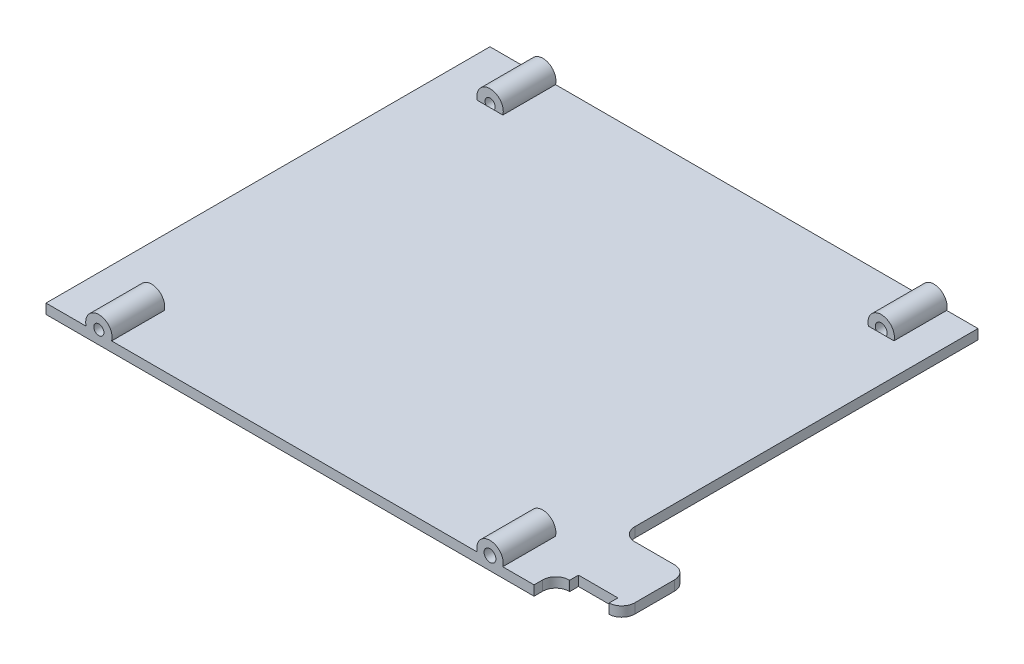
ISO-10303-21;
HEADER;
FILE_DESCRIPTION(('STEP AP214'),'2;1');
FILE_NAME('part.step','',(''),(''),'','','');
FILE_SCHEMA(('AUTOMOTIVE_DESIGN { 1 0 10303 214 1 1 1 1 }'));
ENDSEC;
DATA;
#1=APPLICATION_CONTEXT('core data for automotive mechanical design processes');
#2=APPLICATION_PROTOCOL_DEFINITION('international standard','automotive_design',2000,#1);
#3=PRODUCT_CONTEXT('',#1,'mechanical');
#4=PRODUCT('Part','Part','',(#3));
#5=PRODUCT_RELATED_PRODUCT_CATEGORY('part','',(#4));
#6=PRODUCT_DEFINITION_FORMATION('','',#4);
#7=PRODUCT_DEFINITION_CONTEXT('part definition',#1,'design');
#8=PRODUCT_DEFINITION('design','',#6,#7);
#9=PRODUCT_DEFINITION_SHAPE('','',#8);
#10=(LENGTH_UNIT() NAMED_UNIT(*) SI_UNIT(.MILLI.,.METRE.));
#11=(NAMED_UNIT(*) PLANE_ANGLE_UNIT() SI_UNIT($,.RADIAN.));
#12=(NAMED_UNIT(*) SI_UNIT($,.STERADIAN.) SOLID_ANGLE_UNIT());
#13=UNCERTAINTY_MEASURE_WITH_UNIT(LENGTH_MEASURE(1.E-05),#10,'distance_accuracy_value','');
#14=(GEOMETRIC_REPRESENTATION_CONTEXT(3) GLOBAL_UNCERTAINTY_ASSIGNED_CONTEXT((#13)) GLOBAL_UNIT_ASSIGNED_CONTEXT((#10,
#11,#12)) REPRESENTATION_CONTEXT('',''));
#15=CARTESIAN_POINT('',(0.,0.,0.));
#16=DIRECTION('',(0.,0.,1.));
#17=DIRECTION('',(1.,0.,0.));
#18=AXIS2_PLACEMENT_3D('',#15,#16,#17);
#19=CARTESIAN_POINT('',(-85.5905303741347,-18.8675075749451,141.47256301662));
#20=DIRECTION('',(-1.,0.,0.));
#21=DIRECTION('',(0.,-1.,0.));
#22=AXIS2_PLACEMENT_3D('',#19,#20,#21);
#23=PLANE('',#22);
#24=DIRECTION('',(0.,0.999999944421006,-0.000333403637407651));
#25=VECTOR('',#24,1.);
#26=CARTESIAN_POINT('',(-85.5905303741347,-20.3675075749451,52.0805001054825));
#27=LINE('',#26,#25);
#28=CARTESIAN_POINT('',(-85.5905303741347,-20.3675075749451,52.0805001054825));
#29=VERTEX_POINT('',#28);
#30=CARTESIAN_POINT('',(-85.5905303741347,-18.8675075749451,52.0799999999986));
#31=VERTEX_POINT('',#30);
#32=EDGE_CURVE('E249',#29,#31,#27,.T.);
#33=ORIENTED_EDGE('',*,*,#32,.F.);
#34=DIRECTION('',(0.,0.,-1.));
#35=VECTOR('',#34,1.);
#36=CARTESIAN_POINT('',(-85.5905303741347,-20.3675075749451,141.47256301662));
#37=LINE('',#36,#35);
#38=CARTESIAN_POINT('',(-85.5905303741347,-20.3675075749451,0.));
#39=VERTEX_POINT('',#38);
#40=EDGE_CURVE('E398',#29,#39,#37,.T.);
#41=ORIENTED_EDGE('',*,*,#40,.T.);
#42=DIRECTION('',(0.,1.,0.));
#43=VECTOR('',#42,1.);
#44=CARTESIAN_POINT('',(-85.5905303741347,-18.8675075749451,0.));
#45=LINE('',#44,#43);
#46=CARTESIAN_POINT('',(-85.5905303741347,-18.8675075749451,0.));
#47=VERTEX_POINT('',#46);
#48=EDGE_CURVE('E390',#39,#47,#45,.T.);
#49=ORIENTED_EDGE('',*,*,#48,.T.);
#50=DIRECTION('',(0.,0.,-1.));
#51=VECTOR('',#50,1.);
#52=CARTESIAN_POINT('',(-85.5905303741347,-18.8675075749451,141.47256301662));
#53=LINE('',#52,#51);
#54=EDGE_CURVE('E393',#31,#47,#53,.T.);
#55=ORIENTED_EDGE('',*,*,#54,.F.);
#56=EDGE_LOOP('',(#33,#41,#49,#55));
#57=FACE_BOUND('',#56,.T.);
#58=ADVANCED_FACE('F39',(#57),#23,.F.);
#59=CARTESIAN_POINT('',(-159.667908124511,-18.8675075749451,141.47256301662));
#60=DIRECTION('',(0.,-1.,0.));
#61=DIRECTION('',(1.,0.,0.));
#62=AXIS2_PLACEMENT_3D('',#59,#60,#61);
#63=PLANE('',#62);
#64=DIRECTION('',(1.,0.,0.));
#65=VECTOR('',#64,1.);
#66=CARTESIAN_POINT('',(-159.667908124511,-18.8675075749451,62.7311529803631));
#67=LINE('',#66,#65);
#68=CARTESIAN_POINT('',(-83.4954652130825,-18.8675075749451,62.7311529803631));
#69=VERTEX_POINT('',#68);
#70=CARTESIAN_POINT('',(-77.5092926086521,-18.8675075749451,62.7311529803631));
#71=VERTEX_POINT('',#70);
#72=EDGE_CURVE('E224',#69,#71,#67,.T.);
#73=ORIENTED_EDGE('',*,*,#72,.T.);
#74=DIRECTION('',(0.,0.,1.));
#75=VECTOR('',#74,1.);
#76=CARTESIAN_POINT('',(-77.5092926086521,-18.8675075749451,141.47256301662));
#77=LINE('',#76,#75);
#78=CARTESIAN_POINT('',(-77.5092926086521,-18.8675075749449,64.0783494252642));
#79=VERTEX_POINT('',#78);
#80=EDGE_CURVE('E242',#71,#79,#77,.T.);
#81=ORIENTED_EDGE('',*,*,#80,.T.);
#82=CARTESIAN_POINT('',(-77.5905303741347,-18.867507574945,62.0799999999986));
#83=DIRECTION('',(0.,-1.,0.));
#84=DIRECTION('',(1.,0.,0.));
#85=AXIS2_PLACEMENT_3D('',#82,#83,#84);
#86=CIRCLE('',#85,2.);
#87=CARTESIAN_POINT('',(-75.5905303741347,-18.867507574945,62.0799999999986));
#88=VERTEX_POINT('',#87);
#89=EDGE_CURVE('E261',#88,#79,#86,.T.);
#90=ORIENTED_EDGE('',*,*,#89,.F.);
#91=DIRECTION('',(0.,0.,1.));
#92=VECTOR('',#91,1.);
#93=CARTESIAN_POINT('',(-75.5905303741347,-18.867507574945,52.0799999999985));
#94=LINE('',#93,#92);
#95=CARTESIAN_POINT('',(-75.5905303741347,-18.867507574945,56.0799999999986));
#96=VERTEX_POINT('',#95);
#97=EDGE_CURVE('E258',#96,#88,#94,.T.);
#98=ORIENTED_EDGE('',*,*,#97,.F.);
#99=CARTESIAN_POINT('',(-77.5905303741347,-18.867507574945,56.0799999999986));
#100=DIRECTION('',(0.,-1.,0.));
#101=DIRECTION('',(1.,0.,0.));
#102=AXIS2_PLACEMENT_3D('',#99,#100,#101);
#103=CIRCLE('',#102,2.);
#104=CARTESIAN_POINT('',(-77.5905303741347,-18.867507574945,54.0799999999986));
#105=VERTEX_POINT('',#104);
#106=EDGE_CURVE('E255',#105,#96,#103,.T.);
#107=ORIENTED_EDGE('',*,*,#106,.F.);
#108=DIRECTION('',(1.,0.,0.));
#109=VECTOR('',#108,1.);
#110=CARTESIAN_POINT('',(-33.1479999999989,-18.8675075749446,54.0799999999986));
#111=LINE('',#110,#109);
#112=CARTESIAN_POINT('',(-83.5905303741347,-18.8675075749451,54.0799999999986));
#113=VERTEX_POINT('',#112);
#114=EDGE_CURVE('E253',#113,#105,#111,.T.);
#115=ORIENTED_EDGE('',*,*,#114,.F.);
#116=CARTESIAN_POINT('',(-83.5905303741347,-18.8675075749451,52.0799999999986));
#117=DIRECTION('',(0.,-1.,0.));
#118=DIRECTION('',(1.,0.,0.));
#119=AXIS2_PLACEMENT_3D('',#116,#117,#118);
#120=CIRCLE('',#119,2.);
#121=EDGE_CURVE('E62',#113,#31,#120,.T.);
#122=ORIENTED_EDGE('',*,*,#121,.T.);
#123=ORIENTED_EDGE('',*,*,#54,.T.);
#124=DIRECTION('',(-1.,0.,0.));
#125=VECTOR('',#124,1.);
#126=CARTESIAN_POINT('',(-159.667908124511,-18.8675075749451,0.));
#127=LINE('',#126,#125);
#128=CARTESIAN_POINT('',(-90.3438704257039,-18.8675075749451,0.));
#129=VERTEX_POINT('',#128);
#130=EDGE_CURVE('E386',#47,#129,#127,.T.);
#131=ORIENTED_EDGE('',*,*,#130,.T.);
#132=DIRECTION('',(0.,0.,-1.));
#133=VECTOR('',#132,1.);
#134=CARTESIAN_POINT('',(-90.3438704257039,-18.8675075749451,8.));
#135=LINE('',#134,#133);
#136=CARTESIAN_POINT('',(-90.3438704257039,-18.8675075749451,8.));
#137=VERTEX_POINT('',#136);
#138=EDGE_CURVE('E360',#137,#129,#135,.T.);
#139=ORIENTED_EDGE('',*,*,#138,.F.);
#140=DIRECTION('',(-1.,0.,0.));
#141=VECTOR('',#140,1.);
#142=CARTESIAN_POINT('',(-159.667908124511,-18.8675075749451,8.00000000000001));
#143=LINE('',#142,#141);
#144=CARTESIAN_POINT('',(-91.5320306214526,-18.8675075749451,8.));
#145=VERTEX_POINT('',#144);
#146=EDGE_CURVE('E420',#137,#145,#143,.T.);
#147=ORIENTED_EDGE('',*,*,#146,.T.);
#148=CARTESIAN_POINT('',(-93.0286935761624,-18.8675075749451,8.));
#149=VERTEX_POINT('',#148);
#150=EDGE_CURVE('E424',#145,#149,#143,.T.);
#151=ORIENTED_EDGE('',*,*,#150,.T.);
#152=CARTESIAN_POINT('',(-94.2168537719112,-18.8675075749451,8.));
#153=VERTEX_POINT('',#152);
#154=EDGE_CURVE('E402',#149,#153,#143,.T.);
#155=ORIENTED_EDGE('',*,*,#154,.T.);
#156=DIRECTION('',(0.,0.,-1.));
#157=VECTOR('',#156,1.);
#158=CARTESIAN_POINT('',(-94.2168537719112,-18.8675075749451,8.));
#159=LINE('',#158,#157);
#160=CARTESIAN_POINT('',(-94.2168537719112,-18.8675075749451,0.));
#161=VERTEX_POINT('',#160);
#162=EDGE_CURVE('E371',#161,#153,#159,.F.);
#163=ORIENTED_EDGE('',*,*,#162,.F.);
#164=CARTESIAN_POINT('',(-149.708016259504,-18.8675075749451,0.));
#165=VERTEX_POINT('',#164);
#166=EDGE_CURVE('E388',#161,#165,#127,.T.);
#167=ORIENTED_EDGE('',*,*,#166,.T.);
#168=DIRECTION('',(0.,0.,-1.));
#169=VECTOR('',#168,1.);
#170=CARTESIAN_POINT('',(-149.708016259504,-18.8675075749451,8.));
#171=LINE('',#170,#169);
#172=CARTESIAN_POINT('',(-149.708016259504,-18.8675075749451,8.));
#173=VERTEX_POINT('',#172);
#174=EDGE_CURVE('E374',#173,#165,#171,.T.);
#175=ORIENTED_EDGE('',*,*,#174,.F.);
#176=DIRECTION('',(-1.,0.,0.));
#177=VECTOR('',#176,1.);
#178=CARTESIAN_POINT('',(-159.667908124511,-18.8675075749451,8.00000000000001));
#179=LINE('',#178,#177);
#180=CARTESIAN_POINT('',(-151.059398233736,-18.8675075749451,8.));
#181=VERTEX_POINT('',#180);
#182=EDGE_CURVE('E425',#173,#181,#179,.T.);
#183=ORIENTED_EDGE('',*,*,#182,.T.);
#184=CARTESIAN_POINT('',(-152.22961763148,-18.8675075749451,8.));
#185=VERTEX_POINT('',#184);
#186=EDGE_CURVE('E429',#181,#185,#179,.T.);
#187=ORIENTED_EDGE('',*,*,#186,.T.);
#188=CARTESIAN_POINT('',(-153.580999605712,-18.8675075749451,8.));
#189=VERTEX_POINT('',#188);
#190=EDGE_CURVE('E423',#185,#189,#179,.T.);
#191=ORIENTED_EDGE('',*,*,#190,.T.);
#192=DIRECTION('',(0.,0.,-1.));
#193=VECTOR('',#192,1.);
#194=CARTESIAN_POINT('',(-153.580999605712,-18.8675075749451,8.));
#195=LINE('',#194,#193);
#196=CARTESIAN_POINT('',(-153.580999605712,-18.8675075749451,0.));
#197=VERTEX_POINT('',#196);
#198=EDGE_CURVE('E377',#197,#189,#195,.F.);
#199=ORIENTED_EDGE('',*,*,#198,.F.);
#200=CARTESIAN_POINT('',(-159.667908124511,-18.8675075749451,0.));
#201=VERTEX_POINT('',#200);
#202=EDGE_CURVE('E389',#197,#201,#127,.T.);
#203=ORIENTED_EDGE('',*,*,#202,.T.);
#204=DIRECTION('',(0.,0.,-1.));
#205=VECTOR('',#204,1.);
#206=CARTESIAN_POINT('',(-159.667908124511,-18.8675075749451,141.47256301662));
#207=LINE('',#206,#205);
#208=CARTESIAN_POINT('',(-159.667908124511,-18.8675075749451,67.3799999999986));
#209=VERTEX_POINT('',#208);
#210=EDGE_CURVE('E385',#209,#201,#207,.T.);
#211=ORIENTED_EDGE('',*,*,#210,.F.);
#212=DIRECTION('',(-1.,0.,0.));
#213=VECTOR('',#212,1.);
#214=CARTESIAN_POINT('',(-159.667908124511,-18.8675075749451,67.3799999999986));
#215=LINE('',#214,#213);
#216=CARTESIAN_POINT('',(-153.580999605713,-18.8675075749451,67.3799999999986));
#217=VERTEX_POINT('',#216);
#218=EDGE_CURVE('E404',#217,#209,#215,.T.);
#219=ORIENTED_EDGE('',*,*,#218,.F.);
#220=DIRECTION('',(0.,0.,1.));
#221=VECTOR('',#220,1.);
#222=CARTESIAN_POINT('',(-153.580999605713,-18.8675075749451,59.3799999999986));
#223=LINE('',#222,#221);
#224=CARTESIAN_POINT('',(-153.580999605713,-18.8675075749451,59.3799999999986));
#225=VERTEX_POINT('',#224);
#226=EDGE_CURVE('E328',#225,#217,#223,.T.);
#227=ORIENTED_EDGE('',*,*,#226,.F.);
#228=DIRECTION('',(1.,0.,0.));
#229=VECTOR('',#228,1.);
#230=CARTESIAN_POINT('',(-159.667908124511,-18.8675075749451,59.3799999999985));
#231=LINE('',#230,#229);
#232=CARTESIAN_POINT('',(-152.22961763148,-18.8675075749451,59.3799999999986));
#233=VERTEX_POINT('',#232);
#234=EDGE_CURVE('E340',#225,#233,#231,.T.);
#235=ORIENTED_EDGE('',*,*,#234,.T.);
#236=CARTESIAN_POINT('',(-151.059398233736,-18.8675075749451,59.3799999999986));
#237=VERTEX_POINT('',#236);
#238=EDGE_CURVE('E344',#233,#237,#231,.T.);
#239=ORIENTED_EDGE('',*,*,#238,.T.);
#240=CARTESIAN_POINT('',(-149.708016259504,-18.8675075749451,59.3799999999986));
#241=VERTEX_POINT('',#240);
#242=EDGE_CURVE('E338',#237,#241,#231,.T.);
#243=ORIENTED_EDGE('',*,*,#242,.T.);
#244=DIRECTION('',(0.,0.,1.));
#245=VECTOR('',#244,1.);
#246=CARTESIAN_POINT('',(-149.708016259504,-18.8675075749451,59.3799999999986));
#247=LINE('',#246,#245);
#248=CARTESIAN_POINT('',(-149.708016259504,-18.8675075749451,67.3799999999985));
#249=VERTEX_POINT('',#248);
#250=EDGE_CURVE('E331',#249,#241,#247,.F.);
#251=ORIENTED_EDGE('',*,*,#250,.F.);
#252=CARTESIAN_POINT('',(-94.2168537719119,-18.8675075749451,67.3799999999986));
#253=VERTEX_POINT('',#252);
#254=EDGE_CURVE('E403',#253,#249,#215,.T.);
#255=ORIENTED_EDGE('',*,*,#254,.F.);
#256=DIRECTION('',(0.,0.,1.));
#257=VECTOR('',#256,1.);
#258=CARTESIAN_POINT('',(-94.2168537719119,-18.8675075749451,59.3799999999986));
#259=LINE('',#258,#257);
#260=CARTESIAN_POINT('',(-94.2168537719119,-18.8675075749451,59.3799999999986));
#261=VERTEX_POINT('',#260);
#262=EDGE_CURVE('E316',#261,#253,#259,.T.);
#263=ORIENTED_EDGE('',*,*,#262,.F.);
#264=DIRECTION('',(1.,0.,0.));
#265=VECTOR('',#264,1.);
#266=CARTESIAN_POINT('',(-159.667908124511,-18.8675075749451,59.3799999999986));
#267=LINE('',#266,#265);
#268=CARTESIAN_POINT('',(-93.028693576163,-18.8675075749451,59.3799999999986));
#269=VERTEX_POINT('',#268);
#270=EDGE_CURVE('E335',#261,#269,#267,.T.);
#271=ORIENTED_EDGE('',*,*,#270,.T.);
#272=CARTESIAN_POINT('',(-91.5320306214525,-18.8675075749451,59.3799999999986));
#273=VERTEX_POINT('',#272);
#274=EDGE_CURVE('E339',#269,#273,#267,.T.);
#275=ORIENTED_EDGE('',*,*,#274,.T.);
#276=CARTESIAN_POINT('',(-90.3438704257038,-18.8675075749451,59.3799999999986));
#277=VERTEX_POINT('',#276);
#278=EDGE_CURVE('E334',#273,#277,#267,.T.);
#279=ORIENTED_EDGE('',*,*,#278,.T.);
#280=DIRECTION('',(0.,0.,1.));
#281=VECTOR('',#280,1.);
#282=CARTESIAN_POINT('',(-90.3438704257038,-18.8675075749451,59.3799999999986));
#283=LINE('',#282,#281);
#284=CARTESIAN_POINT('',(-90.3438704257038,-18.8675075749451,67.3799999999986));
#285=VERTEX_POINT('',#284);
#286=EDGE_CURVE('E325',#285,#277,#283,.F.);
#287=ORIENTED_EDGE('',*,*,#286,.F.);
#288=CARTESIAN_POINT('',(-85.5905303741347,-18.8675075749451,67.3799999999986));
#289=VERTEX_POINT('',#288);
#290=EDGE_CURVE('E399',#289,#285,#215,.T.);
#291=ORIENTED_EDGE('',*,*,#290,.F.);
#292=CARTESIAN_POINT('',(-85.5905303741347,-18.8675075749451,66.0799999999986));
#293=VERTEX_POINT('',#292);
#294=EDGE_CURVE('E414',#289,#293,#53,.T.);
#295=ORIENTED_EDGE('',*,*,#294,.T.);
#296=CARTESIAN_POINT('',(-83.5905303741347,-18.8675075749451,66.0799999999986));
#297=DIRECTION('',(0.,-1.,0.));
#298=DIRECTION('',(1.,0.,0.));
#299=AXIS2_PLACEMENT_3D('',#296,#297,#298);
#300=CIRCLE('',#299,2.);
#301=CARTESIAN_POINT('',(-83.5905303741347,-18.8675075749451,64.0799999999986));
#302=VERTEX_POINT('',#301);
#303=EDGE_CURVE('E270',#293,#302,#300,.T.);
#304=ORIENTED_EDGE('',*,*,#303,.T.);
#305=DIRECTION('',(-1.,0.,0.));
#306=VECTOR('',#305,1.);
#307=CARTESIAN_POINT('',(-33.1479999999989,-18.8675075749446,64.0799999999986));
#308=LINE('',#307,#306);
#309=CARTESIAN_POINT('',(-83.4954652130825,-18.8675075749449,64.0799999999986));
#310=VERTEX_POINT('',#309);
#311=EDGE_CURVE('E264',#310,#302,#308,.T.);
#312=ORIENTED_EDGE('',*,*,#311,.F.);
#313=DIRECTION('',(0.,0.,-1.));
#314=VECTOR('',#313,1.);
#315=CARTESIAN_POINT('',(-83.4954652130825,-18.8675075749451,141.47256301662));
#316=LINE('',#315,#314);
#317=EDGE_CURVE('E246',#310,#69,#316,.T.);
#318=ORIENTED_EDGE('',*,*,#317,.T.);
#319=EDGE_LOOP('',(#73,#81,#90,#98,#107,#115,#122,#123,#131,#139,#147,#151,#155,#163,#167,#175,
#183,#187,#191,#199,#203,#211,#219,#227,#235,#239,#243,#251,#255,#263,#271,#275,#279,#287,#291,
#295,#304,#312,#318));
#320=FACE_BOUND('',#319,.T.);
#321=ADVANCED_FACE('F438',(#320),#63,.F.);
#322=CARTESIAN_POINT('',(-85.5905303741347,-20.3675075749451,141.47256301662));
#323=DIRECTION('',(0.,1.,0.));
#324=DIRECTION('',(-1.,0.,0.));
#325=AXIS2_PLACEMENT_3D('',#322,#323,#324);
#326=PLANE('',#325);
#327=CARTESIAN_POINT('',(-77.5905303741347,-20.3675075749451,62.0799999999986));
#328=DIRECTION('',(0.,1.,0.));
#329=DIRECTION('',(-1.,0.,0.));
#330=AXIS2_PLACEMENT_3D('',#327,#328,#329);
#331=CIRCLE('',#330,2.);
#332=CARTESIAN_POINT('',(-77.5092926086521,-20.3675075749451,64.0783494252642));
#333=VERTEX_POINT('',#332);
#334=CARTESIAN_POINT('',(-75.5905303741347,-20.3675075749451,62.0799999999986));
#335=VERTEX_POINT('',#334);
#336=EDGE_CURVE('E277',#333,#335,#331,.T.);
#337=ORIENTED_EDGE('',*,*,#336,.F.);
#338=DIRECTION('',(0.,0.,1.));
#339=VECTOR('',#338,1.);
#340=CARTESIAN_POINT('',(-77.5092926086521,-20.3675075749454,62.7311529803631));
#341=LINE('',#340,#339);
#342=CARTESIAN_POINT('',(-77.5092926086521,-20.3675075749454,62.7311529803631));
#343=VERTEX_POINT('',#342);
#344=EDGE_CURVE('E54',#343,#333,#341,.T.);
#345=ORIENTED_EDGE('',*,*,#344,.F.);
#346=DIRECTION('',(1.,0.,0.));
#347=VECTOR('',#346,1.);
#348=CARTESIAN_POINT('',(-83.4954652130825,-20.3675075749454,62.7311529803631));
#349=LINE('',#348,#347);
#350=CARTESIAN_POINT('',(-83.4954652130825,-20.3675075749454,62.7311529803631));
#351=VERTEX_POINT('',#350);
#352=EDGE_CURVE('E222',#351,#343,#349,.T.);
#353=ORIENTED_EDGE('',*,*,#352,.F.);
#354=DIRECTION('',(0.,0.,-1.));
#355=VECTOR('',#354,1.);
#356=CARTESIAN_POINT('',(-83.4954652130825,-20.3675075749454,66.6522392252637));
#357=LINE('',#356,#355);
#358=CARTESIAN_POINT('',(-83.4954652130825,-20.3675075749454,64.0799999999986));
#359=VERTEX_POINT('',#358);
#360=EDGE_CURVE('E230',#359,#351,#357,.T.);
#361=ORIENTED_EDGE('',*,*,#360,.F.);
#362=DIRECTION('',(1.,0.,0.));
#363=VECTOR('',#362,1.);
#364=CARTESIAN_POINT('',(-85.5905303741346,-20.3675075749451,64.0799999999986));
#365=LINE('',#364,#363);
#366=CARTESIAN_POINT('',(-83.5905303741347,-20.3675075749451,64.0799999999986));
#367=VERTEX_POINT('',#366);
#368=EDGE_CURVE('E275',#367,#359,#365,.T.);
#369=ORIENTED_EDGE('',*,*,#368,.F.);
#370=CARTESIAN_POINT('',(-83.5905303741347,-20.3675075749451,66.0799999999986));
#371=DIRECTION('',(0.,1.,0.));
#372=DIRECTION('',(-1.,0.,0.));
#373=AXIS2_PLACEMENT_3D('',#370,#371,#372);
#374=CIRCLE('',#373,2.);
#375=CARTESIAN_POINT('',(-85.5905303741347,-20.3675075749451,66.0799999999986));
#376=VERTEX_POINT('',#375);
#377=EDGE_CURVE('E273',#376,#367,#374,.F.);
#378=ORIENTED_EDGE('',*,*,#377,.F.);
#379=CARTESIAN_POINT('',(-85.5905303741347,-20.3675075749451,67.3799999999986));
#380=VERTEX_POINT('',#379);
#381=EDGE_CURVE('E394',#380,#376,#37,.T.);
#382=ORIENTED_EDGE('',*,*,#381,.F.);
#383=DIRECTION('',(1.,0.,0.));
#384=VECTOR('',#383,1.);
#385=CARTESIAN_POINT('',(-85.5905303741347,-20.3675075749451,67.3799999999986));
#386=LINE('',#385,#384);
#387=CARTESIAN_POINT('',(-159.667908124511,-20.3675075749451,67.3799999999986));
#388=VERTEX_POINT('',#387);
#389=EDGE_CURVE('E408',#388,#380,#386,.T.);
#390=ORIENTED_EDGE('',*,*,#389,.F.);
#391=DIRECTION('',(0.,0.,-1.));
#392=VECTOR('',#391,1.);
#393=CARTESIAN_POINT('',(-159.667908124511,-20.3675075749451,141.47256301662));
#394=LINE('',#393,#392);
#395=CARTESIAN_POINT('',(-159.667908124511,-20.3675075749451,0.));
#396=VERTEX_POINT('',#395);
#397=EDGE_CURVE('E380',#388,#396,#394,.T.);
#398=ORIENTED_EDGE('',*,*,#397,.T.);
#399=DIRECTION('',(1.,0.,0.));
#400=VECTOR('',#399,1.);
#401=CARTESIAN_POINT('',(-85.5905303741347,-20.3675075749451,0.));
#402=LINE('',#401,#400);
#403=EDGE_CURVE('E395',#396,#39,#402,.T.);
#404=ORIENTED_EDGE('',*,*,#403,.T.);
#405=ORIENTED_EDGE('',*,*,#40,.F.);
#406=CARTESIAN_POINT('',(-83.5905303741347,-20.3675075749451,52.0799999999986));
#407=DIRECTION('',(0.,1.,0.));
#408=DIRECTION('',(-1.,0.,0.));
#409=AXIS2_PLACEMENT_3D('',#406,#407,#408);
#410=CIRCLE('',#409,2.);
#411=CARTESIAN_POINT('',(-83.5905303741347,-20.3675075749451,54.0799999999986));
#412=VERTEX_POINT('',#411);
#413=EDGE_CURVE('E267',#29,#412,#410,.T.);
#414=ORIENTED_EDGE('',*,*,#413,.T.);
#415=DIRECTION('',(-1.,0.,0.));
#416=VECTOR('',#415,1.);
#417=CARTESIAN_POINT('',(-75.5905303741347,-20.3675075749451,54.0799999999986));
#418=LINE('',#417,#416);
#419=CARTESIAN_POINT('',(-77.5905303741347,-20.3675075749451,54.0799999999986));
#420=VERTEX_POINT('',#419);
#421=EDGE_CURVE('E269',#420,#412,#418,.T.);
#422=ORIENTED_EDGE('',*,*,#421,.F.);
#423=CARTESIAN_POINT('',(-77.5905303741347,-20.3675075749451,56.0799999999986));
#424=DIRECTION('',(0.,1.,0.));
#425=DIRECTION('',(-1.,0.,0.));
#426=AXIS2_PLACEMENT_3D('',#423,#424,#425);
#427=CIRCLE('',#426,2.);
#428=CARTESIAN_POINT('',(-75.5905303741347,-20.3675075749451,56.0799999999986));
#429=VERTEX_POINT('',#428);
#430=EDGE_CURVE('E266',#429,#420,#427,.T.);
#431=ORIENTED_EDGE('',*,*,#430,.F.);
#432=DIRECTION('',(0.,0.,-1.));
#433=VECTOR('',#432,1.);
#434=CARTESIAN_POINT('',(-75.5905303741347,-20.3675075749451,64.0799999999986));
#435=LINE('',#434,#433);
#436=EDGE_CURVE('E279',#335,#429,#435,.T.);
#437=ORIENTED_EDGE('',*,*,#436,.F.);
#438=EDGE_LOOP('',(#337,#345,#353,#361,#369,#378,#382,#390,#398,#404,#405,#414,#422,#431,#437));
#439=FACE_BOUND('',#438,.T.);
#440=ADVANCED_FACE('F238',(#439),#326,.F.);
#441=ORIENTED_EDGE('',*,*,#381,.T.);
#442=DIRECTION('',(0.,1.,0.));
#443=VECTOR('',#442,1.);
#444=CARTESIAN_POINT('',(-85.5905303741347,19.6324924250548,66.0799999999986));
#445=LINE('',#444,#443);
#446=EDGE_CURVE('E252',#293,#376,#445,.F.);
#447=ORIENTED_EDGE('',*,*,#446,.F.);
#448=ORIENTED_EDGE('',*,*,#294,.F.);
#449=DIRECTION('',(0.,1.,0.));
#450=VECTOR('',#449,1.);
#451=CARTESIAN_POINT('',(-85.5905303741347,-18.867507574945,67.3799999999986));
#452=LINE('',#451,#450);
#453=EDGE_CURVE('E405',#380,#289,#452,.T.);
#454=ORIENTED_EDGE('',*,*,#453,.F.);
#455=EDGE_LOOP('',(#441,#447,#448,#454));
#456=FACE_BOUND('',#455,.T.);
#457=ADVANCED_FACE('F497',(#456),#23,.F.);
#458=CARTESIAN_POINT('',(-159.667908124511,-20.3675075749451,141.47256301662));
#459=DIRECTION('',(1.,0.,0.));
#460=DIRECTION('',(0.,0.,-1.));
#461=AXIS2_PLACEMENT_3D('',#458,#459,#460);
#462=PLANE('',#461);
#463=DIRECTION('',(0.,-1.,0.));
#464=VECTOR('',#463,1.);
#465=CARTESIAN_POINT('',(-159.667908124511,-20.367507574945,67.3799999999986));
#466=LINE('',#465,#464);
#467=EDGE_CURVE('E384',#209,#388,#466,.T.);
#468=ORIENTED_EDGE('',*,*,#467,.F.);
#469=ORIENTED_EDGE('',*,*,#210,.T.);
#470=DIRECTION('',(0.,-1.,0.));
#471=VECTOR('',#470,1.);
#472=CARTESIAN_POINT('',(-159.667908124511,-20.3675075749451,0.));
#473=LINE('',#472,#471);
#474=EDGE_CURVE('E381',#201,#396,#473,.T.);
#475=ORIENTED_EDGE('',*,*,#474,.T.);
#476=ORIENTED_EDGE('',*,*,#397,.F.);
#477=EDGE_LOOP('',(#468,#469,#475,#476));
#478=FACE_BOUND('',#477,.T.);
#479=ADVANCED_FACE('F504',(#478),#462,.F.);
#480=CARTESIAN_POINT('',(0.,0.,0.));
#481=DIRECTION('',(0.,0.,-1.));
#482=DIRECTION('',(-1.,0.,0.));
#483=AXIS2_PLACEMENT_3D('',#480,#481,#482);
#484=PLANE('',#483);
#485=CARTESIAN_POINT('',(-151.644507932608,-18.3675075749456,0.));
#486=DIRECTION('',(0.,0.,-1.));
#487=DIRECTION('',(-1.,0.,0.));
#488=AXIS2_PLACEMENT_3D('',#485,#486,#487);
#489=CIRCLE('',#488,0.769644956920995);
#490=CARTESIAN_POINT('',(-152.414152889529,-18.3675075749456,0.));
#491=VERTEX_POINT('',#490);
#492=EDGE_CURVE('E345',#491,#491,#489,.T.);
#493=ORIENTED_EDGE('',*,*,#492,.F.);
#494=EDGE_LOOP('',(#493));
#495=FACE_BOUND('',#494,.T.);
#496=CARTESIAN_POINT('',(-92.2803620988075,-18.3675075749452,0.));
#497=DIRECTION('',(0.,0.,-1.));
#498=DIRECTION('',(-1.,0.,0.));
#499=AXIS2_PLACEMENT_3D('',#496,#497,#498);
#500=CIRCLE('',#499,0.900000000000003);
#501=CARTESIAN_POINT('',(-93.1803620988075,-18.3675075749452,0.));
#502=VERTEX_POINT('',#501);
#503=EDGE_CURVE('E349',#502,#502,#500,.T.);
#504=ORIENTED_EDGE('',*,*,#503,.F.);
#505=EDGE_LOOP('',(#504));
#506=FACE_BOUND('',#505,.T.);
#507=ORIENTED_EDGE('',*,*,#48,.F.);
#508=ORIENTED_EDGE('',*,*,#403,.F.);
#509=ORIENTED_EDGE('',*,*,#474,.F.);
#510=ORIENTED_EDGE('',*,*,#202,.F.);
#511=CARTESIAN_POINT('',(-151.644507932608,-18.3675075749453,0.));
#512=DIRECTION('',(0.,0.,1.));
#513=DIRECTION('',(1.,0.,0.));
#514=AXIS2_PLACEMENT_3D('',#511,#512,#513);
#515=CIRCLE('',#514,2.00000000000008);
#516=EDGE_CURVE('E361',#165,#197,#515,.T.);
#517=ORIENTED_EDGE('',*,*,#516,.F.);
#518=ORIENTED_EDGE('',*,*,#166,.F.);
#519=CARTESIAN_POINT('',(-92.2803620988075,-18.3675075749452,0.));
#520=DIRECTION('',(0.,0.,1.));
#521=DIRECTION('',(1.,0.,0.));
#522=AXIS2_PLACEMENT_3D('',#519,#520,#521);
#523=CIRCLE('',#522,1.99999999999992);
#524=EDGE_CURVE('E364',#129,#161,#523,.T.);
#525=ORIENTED_EDGE('',*,*,#524,.F.);
#526=ORIENTED_EDGE('',*,*,#130,.F.);
#527=EDGE_LOOP('',(#507,#508,#509,#510,#517,#518,#525,#526));
#528=FACE_BOUND('',#527,.T.);
#529=ADVANCED_FACE('F467',(#495,#506,#528),#484,.T.);
#530=CARTESIAN_POINT('',(-53.1500000000001,-0.367507574945579,67.3799999999986));
#531=DIRECTION('',(0.,0.,1.));
#532=DIRECTION('',(0.999885624174656,-0.015124105555629,0.));
#533=AXIS2_PLACEMENT_3D('',#530,#531,#532);
#534=PLANE('',#533);
#535=CARTESIAN_POINT('',(-92.2803620988078,-18.3675075749455,67.3799999999986));
#536=DIRECTION('',(0.,0.,-1.));
#537=DIRECTION('',(0.,1.,0.));
#538=AXIS2_PLACEMENT_3D('',#535,#536,#537);
#539=CIRCLE('',#538,0.900000000000158);
#540=CARTESIAN_POINT('',(-92.2803620988078,-17.4675075749454,67.3799999999986));
#541=VERTEX_POINT('',#540);
#542=EDGE_CURVE('E303',#541,#541,#539,.T.);
#543=ORIENTED_EDGE('',*,*,#542,.T.);
#544=EDGE_LOOP('',(#543));
#545=FACE_BOUND('',#544,.T.);
#546=CARTESIAN_POINT('',(-151.644507932608,-18.3675075749455,67.3799999999985));
#547=DIRECTION('',(0.,0.,-1.));
#548=DIRECTION('',(0.,1.,0.));
#549=AXIS2_PLACEMENT_3D('',#546,#547,#548);
#550=CIRCLE('',#549,0.769644956920995);
#551=CARTESIAN_POINT('',(-151.644507932608,-17.5978626180245,67.3799999999985));
#552=VERTEX_POINT('',#551);
#553=EDGE_CURVE('E286',#552,#552,#550,.T.);
#554=ORIENTED_EDGE('',*,*,#553,.T.);
#555=EDGE_LOOP('',(#554));
#556=FACE_BOUND('',#555,.T.);
#557=ORIENTED_EDGE('',*,*,#290,.T.);
#558=CARTESIAN_POINT('',(-92.2803620988079,-18.3675075749456,67.3799999999986));
#559=DIRECTION('',(0.,0.,-1.));
#560=DIRECTION('',(0.,1.,0.));
#561=AXIS2_PLACEMENT_3D('',#558,#559,#560);
#562=CIRCLE('',#561,2.00000000000021);
#563=EDGE_CURVE('E319',#253,#285,#562,.T.);
#564=ORIENTED_EDGE('',*,*,#563,.F.);
#565=ORIENTED_EDGE('',*,*,#254,.T.);
#566=CARTESIAN_POINT('',(-151.644507932608,-18.3675075749456,67.3799999999985));
#567=DIRECTION('',(0.,0.,-1.));
#568=DIRECTION('',(0.,1.,0.));
#569=AXIS2_PLACEMENT_3D('',#566,#567,#568);
#570=CIRCLE('',#569,2.00000000000039);
#571=EDGE_CURVE('E317',#217,#249,#570,.T.);
#572=ORIENTED_EDGE('',*,*,#571,.F.);
#573=ORIENTED_EDGE('',*,*,#218,.T.);
#574=ORIENTED_EDGE('',*,*,#467,.T.);
#575=ORIENTED_EDGE('',*,*,#389,.T.);
#576=ORIENTED_EDGE('',*,*,#453,.T.);
#577=EDGE_LOOP('',(#557,#564,#565,#572,#573,#574,#575,#576));
#578=FACE_BOUND('',#577,.T.);
#579=ADVANCED_FACE('F41',(#545,#556,#578),#534,.T.);
#580=CARTESIAN_POINT('',(-92.2803620988075,-18.3675075749452,8.));
#581=DIRECTION('',(0.,0.,1.));
#582=DIRECTION('',(1.,0.,0.));
#583=AXIS2_PLACEMENT_3D('',#580,#581,#582);
#584=PLANE('',#583);
#585=CARTESIAN_POINT('',(-92.2803620988075,-18.3675075749452,8.));
#586=DIRECTION('',(0.,0.,1.));
#587=DIRECTION('',(1.,0.,0.));
#588=AXIS2_PLACEMENT_3D('',#585,#586,#587);
#589=CIRCLE('',#588,0.900000000000003);
#590=EDGE_CURVE('E431',#145,#149,#589,.T.);
#591=ORIENTED_EDGE('',*,*,#590,.F.);
#592=ORIENTED_EDGE('',*,*,#146,.F.);
#593=CARTESIAN_POINT('',(-92.2803620988075,-18.3675075749452,8.));
#594=DIRECTION('',(0.,0.,1.));
#595=DIRECTION('',(1.,0.,0.));
#596=AXIS2_PLACEMENT_3D('',#593,#594,#595);
#597=CIRCLE('',#596,1.99999999999992);
#598=EDGE_CURVE('E352',#137,#153,#597,.T.);
#599=ORIENTED_EDGE('',*,*,#598,.T.);
#600=ORIENTED_EDGE('',*,*,#154,.F.);
#601=EDGE_LOOP('',(#591,#592,#599,#600));
#602=FACE_BOUND('',#601,.T.);
#603=ADVANCED_FACE('F474',(#602),#584,.T.);
#604=CARTESIAN_POINT('',(-92.2803620988075,-18.3675075749452,8.));
#605=DIRECTION('',(0.,0.,-1.));
#606=DIRECTION('',(-1.,0.,0.));
#607=AXIS2_PLACEMENT_3D('',#604,#605,#606);
#608=CYLINDRICAL_SURFACE('',#607,1.99999999999992);
#609=ORIENTED_EDGE('',*,*,#524,.T.);
#610=ORIENTED_EDGE('',*,*,#162,.T.);
#611=ORIENTED_EDGE('',*,*,#598,.F.);
#612=ORIENTED_EDGE('',*,*,#138,.T.);
#613=EDGE_LOOP('',(#609,#610,#611,#612));
#614=FACE_BOUND('',#613,.T.);
#615=ADVANCED_FACE('F466',(#614),#608,.T.);
#616=CARTESIAN_POINT('',(-151.644507932608,-18.3675075749453,8.));
#617=DIRECTION('',(0.,0.,1.));
#618=DIRECTION('',(1.,0.,0.));
#619=AXIS2_PLACEMENT_3D('',#616,#617,#618);
#620=PLANE('',#619);
#621=CARTESIAN_POINT('',(-151.644507932608,-18.3675075749456,8.));
#622=DIRECTION('',(0.,0.,1.));
#623=DIRECTION('',(1.,0.,0.));
#624=AXIS2_PLACEMENT_3D('',#621,#622,#623);
#625=CIRCLE('',#624,0.769644956920995);
#626=EDGE_CURVE('E428',#181,#185,#625,.T.);
#627=ORIENTED_EDGE('',*,*,#626,.F.);
#628=ORIENTED_EDGE('',*,*,#182,.F.);
#629=CARTESIAN_POINT('',(-151.644507932608,-18.3675075749453,8.));
#630=DIRECTION('',(0.,0.,1.));
#631=DIRECTION('',(1.,0.,0.));
#632=AXIS2_PLACEMENT_3D('',#629,#630,#631);
#633=CIRCLE('',#632,2.00000000000008);
#634=EDGE_CURVE('E357',#173,#189,#633,.T.);
#635=ORIENTED_EDGE('',*,*,#634,.T.);
#636=ORIENTED_EDGE('',*,*,#190,.F.);
#637=EDGE_LOOP('',(#627,#628,#635,#636));
#638=FACE_BOUND('',#637,.T.);
#639=ADVANCED_FACE('F538',(#638),#620,.T.);
#640=CARTESIAN_POINT('',(-151.644507932608,-18.3675075749453,8.));
#641=DIRECTION('',(0.,0.,-1.));
#642=DIRECTION('',(-1.,0.,0.));
#643=AXIS2_PLACEMENT_3D('',#640,#641,#642);
#644=CYLINDRICAL_SURFACE('',#643,2.00000000000008);
#645=ORIENTED_EDGE('',*,*,#516,.T.);
#646=ORIENTED_EDGE('',*,*,#198,.T.);
#647=ORIENTED_EDGE('',*,*,#634,.F.);
#648=ORIENTED_EDGE('',*,*,#174,.T.);
#649=EDGE_LOOP('',(#645,#646,#647,#648));
#650=FACE_BOUND('',#649,.T.);
#651=ADVANCED_FACE('F534',(#650),#644,.T.);
#652=CARTESIAN_POINT('',(-92.2803620988075,-18.3675075749452,8.));
#653=DIRECTION('',(0.,0.,1.));
#654=DIRECTION('',(1.,0.,0.));
#655=AXIS2_PLACEMENT_3D('',#652,#653,#654);
#656=PLANE('',#655);
#657=CARTESIAN_POINT('',(-151.644507932608,-18.3675075749456,8.));
#658=DIRECTION('',(0.,0.,1.));
#659=DIRECTION('',(1.,0.,0.));
#660=AXIS2_PLACEMENT_3D('',#657,#658,#659);
#661=CIRCLE('',#660,0.769644956920995);
#662=EDGE_CURVE('E348',#181,#185,#661,.F.);
#663=ORIENTED_EDGE('',*,*,#662,.T.);
#664=ORIENTED_EDGE('',*,*,#186,.F.);
#665=EDGE_LOOP('',(#663,#664));
#666=FACE_BOUND('',#665,.T.);
#667=ADVANCED_FACE('F542',(#666),#656,.F.);
#668=CARTESIAN_POINT('',(-151.644507932608,-18.3675075749456,10.5455844122716));
#669=DIRECTION('',(0.,0.,-1.));
#670=DIRECTION('',(-1.,0.,0.));
#671=AXIS2_PLACEMENT_3D('',#668,#669,#670);
#672=CYLINDRICAL_SURFACE('',#671,0.769644956920995);
#673=ORIENTED_EDGE('',*,*,#492,.T.);
#674=EDGE_LOOP('',(#673));
#675=FACE_BOUND('',#674,.T.);
#676=ORIENTED_EDGE('',*,*,#662,.F.);
#677=ORIENTED_EDGE('',*,*,#626,.T.);
#678=EDGE_LOOP('',(#676,#677));
#679=FACE_BOUND('',#678,.T.);
#680=ADVANCED_FACE('F492',(#675,#679),#672,.F.);
#681=CARTESIAN_POINT('',(-92.2803620988075,-18.3675075749452,8.));
#682=DIRECTION('',(0.,0.,1.));
#683=DIRECTION('',(1.,0.,0.));
#684=AXIS2_PLACEMENT_3D('',#681,#682,#683);
#685=PLANE('',#684);
#686=CARTESIAN_POINT('',(-92.2803620988075,-18.3675075749452,8.));
#687=DIRECTION('',(0.,0.,1.));
#688=DIRECTION('',(1.,0.,0.));
#689=AXIS2_PLACEMENT_3D('',#686,#687,#688);
#690=CIRCLE('',#689,0.900000000000003);
#691=EDGE_CURVE('E343',#145,#149,#690,.F.);
#692=ORIENTED_EDGE('',*,*,#691,.T.);
#693=ORIENTED_EDGE('',*,*,#150,.F.);
#694=EDGE_LOOP('',(#692,#693));
#695=FACE_BOUND('',#694,.T.);
#696=ADVANCED_FACE('F477',(#695),#685,.F.);
#697=CARTESIAN_POINT('',(-92.2803620988075,-18.3675075749452,10.5455844122716));
#698=DIRECTION('',(0.,0.,-1.));
#699=DIRECTION('',(-1.,0.,0.));
#700=AXIS2_PLACEMENT_3D('',#697,#698,#699);
#701=CYLINDRICAL_SURFACE('',#700,0.900000000000003);
#702=ORIENTED_EDGE('',*,*,#503,.T.);
#703=EDGE_LOOP('',(#702));
#704=FACE_BOUND('',#703,.T.);
#705=ORIENTED_EDGE('',*,*,#691,.F.);
#706=ORIENTED_EDGE('',*,*,#590,.T.);
#707=EDGE_LOOP('',(#705,#706));
#708=FACE_BOUND('',#707,.T.);
#709=ADVANCED_FACE('F479',(#704,#708),#701,.F.);
#710=CARTESIAN_POINT('',(-92.2803620988079,-18.3675075749456,59.3799999999986));
#711=DIRECTION('',(0.,0.,-1.));
#712=DIRECTION('',(0.,1.,0.));
#713=AXIS2_PLACEMENT_3D('',#710,#711,#712);
#714=PLANE('',#713);
#715=CARTESIAN_POINT('',(-92.2803620988078,-18.3675075749455,59.3799999999986));
#716=DIRECTION('',(0.,0.,-1.));
#717=DIRECTION('',(0.,1.,0.));
#718=AXIS2_PLACEMENT_3D('',#715,#716,#717);
#719=CIRCLE('',#718,0.900000000000158);
#720=EDGE_CURVE('E435',#269,#273,#719,.T.);
#721=ORIENTED_EDGE('',*,*,#720,.F.);
#722=ORIENTED_EDGE('',*,*,#270,.F.);
#723=CARTESIAN_POINT('',(-92.2803620988079,-18.3675075749456,59.3799999999986));
#724=DIRECTION('',(0.,0.,-1.));
#725=DIRECTION('',(0.,1.,0.));
#726=AXIS2_PLACEMENT_3D('',#723,#724,#725);
#727=CIRCLE('',#726,2.00000000000021);
#728=EDGE_CURVE('E306',#261,#277,#727,.T.);
#729=ORIENTED_EDGE('',*,*,#728,.T.);
#730=ORIENTED_EDGE('',*,*,#278,.F.);
#731=EDGE_LOOP('',(#721,#722,#729,#730));
#732=FACE_BOUND('',#731,.T.);
#733=ADVANCED_FACE('F481',(#732),#714,.T.);
#734=CARTESIAN_POINT('',(-92.2803620988079,-18.3675075749456,59.3799999999986));
#735=DIRECTION('',(0.,0.,1.));
#736=DIRECTION('',(0.,-1.,0.));
#737=AXIS2_PLACEMENT_3D('',#734,#735,#736);
#738=CYLINDRICAL_SURFACE('',#737,2.00000000000021);
#739=ORIENTED_EDGE('',*,*,#563,.T.);
#740=ORIENTED_EDGE('',*,*,#286,.T.);
#741=ORIENTED_EDGE('',*,*,#728,.F.);
#742=ORIENTED_EDGE('',*,*,#262,.T.);
#743=EDGE_LOOP('',(#739,#740,#741,#742));
#744=FACE_BOUND('',#743,.T.);
#745=ADVANCED_FACE('F489',(#744),#738,.T.);
#746=CARTESIAN_POINT('',(-151.644507932608,-18.3675075749456,59.3799999999986));
#747=DIRECTION('',(0.,0.,-1.));
#748=DIRECTION('',(0.,1.,0.));
#749=AXIS2_PLACEMENT_3D('',#746,#747,#748);
#750=PLANE('',#749);
#751=CARTESIAN_POINT('',(-151.644507932608,-18.3675075749455,59.3799999999986));
#752=DIRECTION('',(0.,0.,-1.));
#753=DIRECTION('',(0.,1.,0.));
#754=AXIS2_PLACEMENT_3D('',#751,#752,#753);
#755=CIRCLE('',#754,0.769644956920995);
#756=EDGE_CURVE('E433',#233,#237,#755,.T.);
#757=ORIENTED_EDGE('',*,*,#756,.F.);
#758=ORIENTED_EDGE('',*,*,#234,.F.);
#759=CARTESIAN_POINT('',(-151.644507932608,-18.3675075749456,59.3799999999986));
#760=DIRECTION('',(0.,0.,-1.));
#761=DIRECTION('',(0.,1.,0.));
#762=AXIS2_PLACEMENT_3D('',#759,#760,#761);
#763=CIRCLE('',#762,2.00000000000039);
#764=EDGE_CURVE('E313',#225,#241,#763,.T.);
#765=ORIENTED_EDGE('',*,*,#764,.T.);
#766=ORIENTED_EDGE('',*,*,#242,.F.);
#767=EDGE_LOOP('',(#757,#758,#765,#766));
#768=FACE_BOUND('',#767,.T.);
#769=ADVANCED_FACE('F555',(#768),#750,.T.);
#770=CARTESIAN_POINT('',(-151.644507932608,-18.3675075749456,59.3799999999986));
#771=DIRECTION('',(0.,0.,1.));
#772=DIRECTION('',(0.,-1.,0.));
#773=AXIS2_PLACEMENT_3D('',#770,#771,#772);
#774=CYLINDRICAL_SURFACE('',#773,2.00000000000039);
#775=ORIENTED_EDGE('',*,*,#571,.T.);
#776=ORIENTED_EDGE('',*,*,#250,.T.);
#777=ORIENTED_EDGE('',*,*,#764,.F.);
#778=ORIENTED_EDGE('',*,*,#226,.T.);
#779=EDGE_LOOP('',(#775,#776,#777,#778));
#780=FACE_BOUND('',#779,.T.);
#781=ADVANCED_FACE('F557',(#780),#774,.T.);
#782=CARTESIAN_POINT('',(-151.644507932608,-18.3675075749455,59.3799999999986));
#783=DIRECTION('',(0.,0.,-1.));
#784=DIRECTION('',(0.,1.,0.));
#785=AXIS2_PLACEMENT_3D('',#782,#783,#784);
#786=PLANE('',#785);
#787=CARTESIAN_POINT('',(-151.644507932608,-18.3675075749455,59.3799999999986));
#788=DIRECTION('',(0.,0.,-1.));
#789=DIRECTION('',(0.,1.,0.));
#790=AXIS2_PLACEMENT_3D('',#787,#788,#789);
#791=CIRCLE('',#790,0.769644956920995);
#792=EDGE_CURVE('E309',#237,#233,#791,.T.);
#793=ORIENTED_EDGE('',*,*,#792,.F.);
#794=ORIENTED_EDGE('',*,*,#238,.F.);
#795=EDGE_LOOP('',(#793,#794));
#796=FACE_BOUND('',#795,.T.);
#797=ADVANCED_FACE('F560',(#796),#786,.F.);
#798=CARTESIAN_POINT('',(-151.644507932608,-18.3675075749455,67.3799999999985));
#799=DIRECTION('',(0.,0.,-1.));
#800=DIRECTION('',(0.,1.,0.));
#801=AXIS2_PLACEMENT_3D('',#798,#799,#800);
#802=CYLINDRICAL_SURFACE('',#801,0.769644956920995);
#803=ORIENTED_EDGE('',*,*,#553,.F.);
#804=EDGE_LOOP('',(#803));
#805=FACE_BOUND('',#804,.T.);
#806=ORIENTED_EDGE('',*,*,#792,.T.);
#807=ORIENTED_EDGE('',*,*,#756,.T.);
#808=EDGE_LOOP('',(#806,#807));
#809=FACE_BOUND('',#808,.T.);
#810=ADVANCED_FACE('F567',(#805,#809),#802,.F.);
#811=CARTESIAN_POINT('',(-92.2803620988078,-18.3675075749455,59.3799999999986));
#812=DIRECTION('',(0.,0.,-1.));
#813=DIRECTION('',(0.,1.,0.));
#814=AXIS2_PLACEMENT_3D('',#811,#812,#813);
#815=PLANE('',#814);
#816=CARTESIAN_POINT('',(-92.2803620988078,-18.3675075749455,59.3799999999986));
#817=DIRECTION('',(0.,0.,-1.));
#818=DIRECTION('',(0.,1.,0.));
#819=AXIS2_PLACEMENT_3D('',#816,#817,#818);
#820=CIRCLE('',#819,0.900000000000158);
#821=EDGE_CURVE('E307',#273,#269,#820,.T.);
#822=ORIENTED_EDGE('',*,*,#821,.F.);
#823=ORIENTED_EDGE('',*,*,#274,.F.);
#824=EDGE_LOOP('',(#822,#823));
#825=FACE_BOUND('',#824,.T.);
#826=ADVANCED_FACE('F571',(#825),#815,.F.);
#827=CARTESIAN_POINT('',(-92.2803620988078,-18.3675075749455,67.3799999999986));
#828=DIRECTION('',(0.,0.,-1.));
#829=DIRECTION('',(0.,1.,0.));
#830=AXIS2_PLACEMENT_3D('',#827,#828,#829);
#831=CYLINDRICAL_SURFACE('',#830,0.900000000000158);
#832=ORIENTED_EDGE('',*,*,#542,.F.);
#833=EDGE_LOOP('',(#832));
#834=FACE_BOUND('',#833,.T.);
#835=ORIENTED_EDGE('',*,*,#821,.T.);
#836=ORIENTED_EDGE('',*,*,#720,.T.);
#837=EDGE_LOOP('',(#835,#836));
#838=FACE_BOUND('',#837,.T.);
#839=ADVANCED_FACE('F573',(#834,#838),#831,.F.);
#840=CARTESIAN_POINT('',(-83.5905303741347,-0.367507574945158,66.0799999999986));
#841=DIRECTION('',(0.,1.,0.));
#842=DIRECTION('',(0.,0.,1.));
#843=AXIS2_PLACEMENT_3D('',#840,#841,#842);
#844=CYLINDRICAL_SURFACE('',#843,2.);
#845=ORIENTED_EDGE('',*,*,#446,.T.);
#846=ORIENTED_EDGE('',*,*,#377,.T.);
#847=DIRECTION('',(0.,1.,0.));
#848=VECTOR('',#847,1.);
#849=CARTESIAN_POINT('',(-83.5905303741347,-0.367507574945156,64.0799999999986));
#850=LINE('',#849,#848);
#851=EDGE_CURVE('E290',#367,#302,#850,.T.);
#852=ORIENTED_EDGE('',*,*,#851,.T.);
#853=ORIENTED_EDGE('',*,*,#303,.F.);
#854=EDGE_LOOP('',(#845,#846,#852,#853));
#855=FACE_BOUND('',#854,.T.);
#856=ADVANCED_FACE('F520',(#855),#844,.F.);
#857=CARTESIAN_POINT('',(-53.1499999999991,-0.367507574945156,64.0799999999986));
#858=DIRECTION('',(0.,0.,1.));
#859=DIRECTION('',(0.,-1.,0.));
#860=AXIS2_PLACEMENT_3D('',#857,#858,#859);
#861=PLANE('',#860);
#862=DIRECTION('',(0.,-1.,0.));
#863=VECTOR('',#862,1.);
#864=CARTESIAN_POINT('',(-83.4954652130825,-0.367507574945257,64.0799999999986));
#865=LINE('',#864,#863);
#866=EDGE_CURVE('E11',#310,#359,#865,.T.);
#867=ORIENTED_EDGE('',*,*,#866,.F.);
#868=ORIENTED_EDGE('',*,*,#311,.T.);
#869=ORIENTED_EDGE('',*,*,#851,.F.);
#870=ORIENTED_EDGE('',*,*,#368,.T.);
#871=EDGE_LOOP('',(#867,#868,#869,#870));
#872=FACE_BOUND('',#871,.T.);
#873=ADVANCED_FACE('F585',(#872),#861,.T.);
#874=CARTESIAN_POINT('',(-77.5905303741347,-20.3675075749451,62.0799999999986));
#875=DIRECTION('',(0.,-1.,0.));
#876=DIRECTION('',(0.,0.,-1.));
#877=AXIS2_PLACEMENT_3D('',#874,#875,#876);
#878=CYLINDRICAL_SURFACE('',#877,2.);
#879=DIRECTION('',(0.,-1.,0.));
#880=VECTOR('',#879,1.);
#881=CARTESIAN_POINT('',(-77.5092926086521,-20.3675075749451,64.0783494252642));
#882=LINE('',#881,#880);
#883=EDGE_CURVE('E47',#333,#79,#882,.F.);
#884=ORIENTED_EDGE('',*,*,#883,.F.);
#885=ORIENTED_EDGE('',*,*,#336,.T.);
#886=DIRECTION('',(0.,1.,0.));
#887=VECTOR('',#886,1.);
#888=CARTESIAN_POINT('',(-75.5905303741347,-17.3675075749451,62.0799999999986));
#889=LINE('',#888,#887);
#890=EDGE_CURVE('E295',#335,#88,#889,.T.);
#891=ORIENTED_EDGE('',*,*,#890,.T.);
#892=ORIENTED_EDGE('',*,*,#89,.T.);
#893=EDGE_LOOP('',(#884,#885,#891,#892));
#894=FACE_BOUND('',#893,.T.);
#895=ADVANCED_FACE('F439',(#894),#878,.T.);
#896=CARTESIAN_POINT('',(-75.5905303741347,-20.3675075749451,64.0799999999986));
#897=DIRECTION('',(1.,0.,0.));
#898=DIRECTION('',(0.,0.,-1.));
#899=AXIS2_PLACEMENT_3D('',#896,#897,#898);
#900=PLANE('',#899);
#901=ORIENTED_EDGE('',*,*,#97,.T.);
#902=ORIENTED_EDGE('',*,*,#890,.F.);
#903=ORIENTED_EDGE('',*,*,#436,.T.);
#904=DIRECTION('',(0.,1.,0.));
#905=VECTOR('',#904,1.);
#906=CARTESIAN_POINT('',(-75.5905303741347,-20.3675075749451,56.0799999999986));
#907=LINE('',#906,#905);
#908=EDGE_CURVE('E251',#96,#429,#907,.F.);
#909=ORIENTED_EDGE('',*,*,#908,.F.);
#910=EDGE_LOOP('',(#901,#902,#903,#909));
#911=FACE_BOUND('',#910,.T.);
#912=ADVANCED_FACE('F444',(#911),#900,.T.);
#913=CARTESIAN_POINT('',(-83.5905303741347,19.6324924250549,52.0799999999986));
#914=DIRECTION('',(0.,1.,0.));
#915=DIRECTION('',(0.,0.,1.));
#916=AXIS2_PLACEMENT_3D('',#913,#914,#915);
#917=CYLINDRICAL_SURFACE('',#916,2.);
#918=ORIENTED_EDGE('',*,*,#121,.F.);
#919=DIRECTION('',(0.,1.,0.));
#920=VECTOR('',#919,1.);
#921=CARTESIAN_POINT('',(-83.5905303741347,-20.3675075749451,54.0799999999986));
#922=LINE('',#921,#920);
#923=EDGE_CURVE('E283',#113,#412,#922,.F.);
#924=ORIENTED_EDGE('',*,*,#923,.T.);
#925=ORIENTED_EDGE('',*,*,#413,.F.);
#926=ORIENTED_EDGE('',*,*,#32,.T.);
#927=EDGE_LOOP('',(#918,#924,#925,#926));
#928=FACE_BOUND('',#927,.T.);
#929=ADVANCED_FACE('F454',(#928),#917,.F.);
#930=CARTESIAN_POINT('',(-75.5905303741347,-20.3675075749451,54.0799999999986));
#931=DIRECTION('',(0.,0.,-1.));
#932=DIRECTION('',(-1.,0.,0.));
#933=AXIS2_PLACEMENT_3D('',#930,#931,#932);
#934=PLANE('',#933);
#935=ORIENTED_EDGE('',*,*,#114,.T.);
#936=DIRECTION('',(0.,1.,0.));
#937=VECTOR('',#936,1.);
#938=CARTESIAN_POINT('',(-77.5905303741347,-17.3675075749451,54.0799999999986));
#939=LINE('',#938,#937);
#940=EDGE_CURVE('E287',#420,#105,#939,.T.);
#941=ORIENTED_EDGE('',*,*,#940,.F.);
#942=ORIENTED_EDGE('',*,*,#421,.T.);
#943=ORIENTED_EDGE('',*,*,#923,.F.);
#944=EDGE_LOOP('',(#935,#941,#942,#943));
#945=FACE_BOUND('',#944,.T.);
#946=ADVANCED_FACE('F451',(#945),#934,.T.);
#947=CARTESIAN_POINT('',(-77.5905303741347,-20.3675075749451,56.0799999999986));
#948=DIRECTION('',(0.,-1.,0.));
#949=DIRECTION('',(0.,0.,-1.));
#950=AXIS2_PLACEMENT_3D('',#947,#948,#949);
#951=CYLINDRICAL_SURFACE('',#950,2.);
#952=ORIENTED_EDGE('',*,*,#106,.T.);
#953=ORIENTED_EDGE('',*,*,#908,.T.);
#954=ORIENTED_EDGE('',*,*,#430,.T.);
#955=ORIENTED_EDGE('',*,*,#940,.T.);
#956=EDGE_LOOP('',(#952,#953,#954,#955));
#957=FACE_BOUND('',#956,.T.);
#958=ADVANCED_FACE('F447',(#957),#951,.T.);
#959=CARTESIAN_POINT('',(-83.4954652130825,-16.3675075749449,62.7311529803631));
#960=DIRECTION('',(0.,0.,-1.));
#961=DIRECTION('',(-1.,0.,0.));
#962=AXIS2_PLACEMENT_3D('',#959,#960,#961);
#963=PLANE('',#962);
#964=DIRECTION('',(0.,-1.,0.));
#965=VECTOR('',#964,1.);
#966=CARTESIAN_POINT('',(-83.4954652130825,-16.3675075749449,62.7311529803631));
#967=LINE('',#966,#965);
#968=EDGE_CURVE('E217',#69,#351,#967,.T.);
#969=ORIENTED_EDGE('',*,*,#968,.T.);
#970=ORIENTED_EDGE('',*,*,#352,.T.);
#971=DIRECTION('',(0.,-1.,0.));
#972=VECTOR('',#971,1.);
#973=CARTESIAN_POINT('',(-77.5092926086521,-16.3675075749449,62.7311529803631));
#974=LINE('',#973,#972);
#975=EDGE_CURVE('E227',#71,#343,#974,.T.);
#976=ORIENTED_EDGE('',*,*,#975,.F.);
#977=ORIENTED_EDGE('',*,*,#72,.F.);
#978=EDGE_LOOP('',(#969,#970,#976,#977));
#979=FACE_BOUND('',#978,.T.);
#980=ADVANCED_FACE('F219',(#979),#963,.F.);
#981=CARTESIAN_POINT('',(-83.4954652130825,-16.3675075749449,66.6522392252637));
#982=DIRECTION('',(-1.,0.,0.));
#983=DIRECTION('',(0.,-1.,0.));
#984=AXIS2_PLACEMENT_3D('',#981,#982,#983);
#985=PLANE('',#984);
#986=ORIENTED_EDGE('',*,*,#866,.T.);
#987=ORIENTED_EDGE('',*,*,#360,.T.);
#988=ORIENTED_EDGE('',*,*,#968,.F.);
#989=ORIENTED_EDGE('',*,*,#317,.F.);
#990=EDGE_LOOP('',(#986,#987,#988,#989));
#991=FACE_BOUND('',#990,.T.);
#992=ADVANCED_FACE('F231',(#991),#985,.F.);
#993=CARTESIAN_POINT('',(-77.5092926086521,-16.3675075749449,62.7311529803631));
#994=DIRECTION('',(1.,0.,0.));
#995=DIRECTION('',(0.,1.,0.));
#996=AXIS2_PLACEMENT_3D('',#993,#994,#995);
#997=PLANE('',#996);
#998=ORIENTED_EDGE('',*,*,#975,.T.);
#999=ORIENTED_EDGE('',*,*,#344,.T.);
#1000=ORIENTED_EDGE('',*,*,#883,.T.);
#1001=ORIENTED_EDGE('',*,*,#80,.F.);
#1002=EDGE_LOOP('',(#998,#999,#1000,#1001));
#1003=FACE_BOUND('',#1002,.T.);
#1004=ADVANCED_FACE('F436',(#1003),#997,.F.);
#1005=CLOSED_SHELL('',(#58,#321,#440,#457,#479,#529,#579,#603,#615,#639,#651,#667,#680,#696,
#709,#733,#745,#769,#781,#797,#810,#826,#839,#856,#873,#895,#912,#929,#946,#958,#980,#992,#1004));
#1006=MANIFOLD_SOLID_BREP('B2',#1005);
#1007=ADVANCED_BREP_SHAPE_REPRESENTATION('',(#18,#1006),#14);
#1008=SHAPE_DEFINITION_REPRESENTATION(#9,#1007);
ENDSEC;
END-ISO-10303-21;
